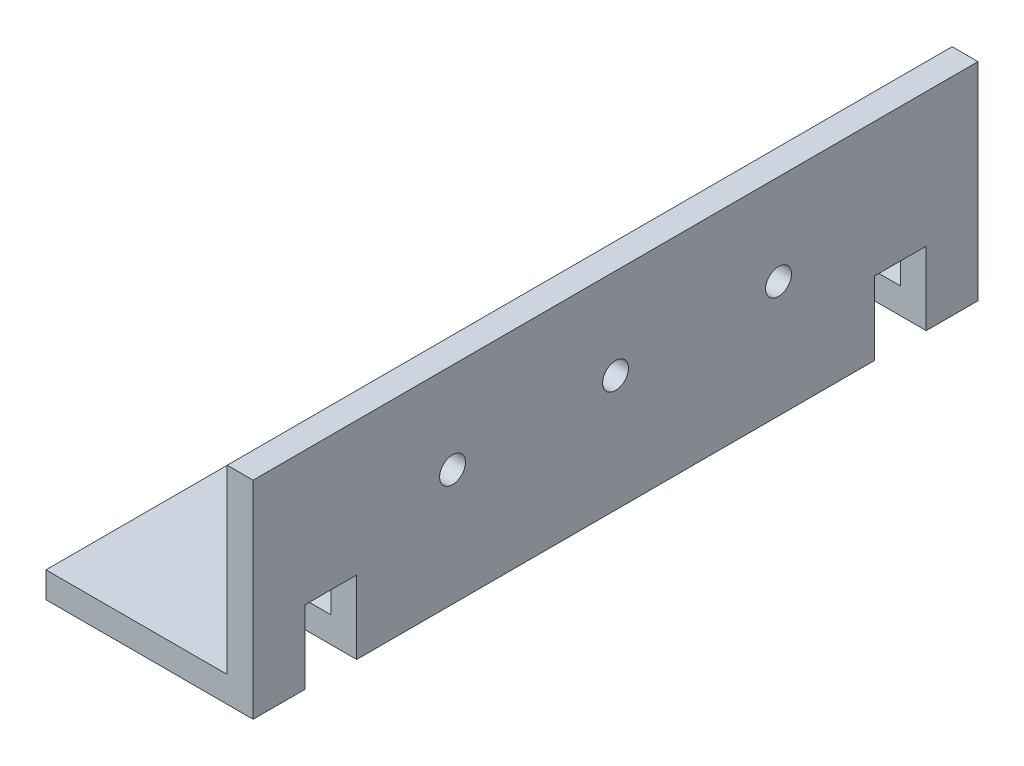
ISO-10303-21;
HEADER;
FILE_DESCRIPTION(('STEP AP214'),'2;1');
FILE_NAME('part.step','',(''),(''),'','','');
FILE_SCHEMA(('AUTOMOTIVE_DESIGN { 1 0 10303 214 1 1 1 1 }'));
ENDSEC;
DATA;
#1=APPLICATION_CONTEXT('core data for automotive mechanical design processes');
#2=APPLICATION_PROTOCOL_DEFINITION('international standard','automotive_design',2000,#1);
#3=PRODUCT_CONTEXT('',#1,'mechanical');
#4=PRODUCT('Part','Part','',(#3));
#5=PRODUCT_RELATED_PRODUCT_CATEGORY('part','',(#4));
#6=PRODUCT_DEFINITION_FORMATION('','',#4);
#7=PRODUCT_DEFINITION_CONTEXT('part definition',#1,'design');
#8=PRODUCT_DEFINITION('design','',#6,#7);
#9=PRODUCT_DEFINITION_SHAPE('','',#8);
#10=(LENGTH_UNIT() NAMED_UNIT(*) SI_UNIT(.MILLI.,.METRE.));
#11=(NAMED_UNIT(*) PLANE_ANGLE_UNIT() SI_UNIT($,.RADIAN.));
#12=(NAMED_UNIT(*) SI_UNIT($,.STERADIAN.) SOLID_ANGLE_UNIT());
#13=UNCERTAINTY_MEASURE_WITH_UNIT(LENGTH_MEASURE(1.E-05),#10,'distance_accuracy_value','');
#14=(GEOMETRIC_REPRESENTATION_CONTEXT(3) GLOBAL_UNCERTAINTY_ASSIGNED_CONTEXT((#13)) GLOBAL_UNIT_ASSIGNED_CONTEXT((#10,
#11,#12)) REPRESENTATION_CONTEXT('',''));
#15=CARTESIAN_POINT('',(0.,0.,0.));
#16=DIRECTION('',(0.,0.,1.));
#17=DIRECTION('',(1.,0.,0.));
#18=AXIS2_PLACEMENT_3D('',#15,#16,#17);
#19=CARTESIAN_POINT('',(-25.4,0.,88.9));
#20=DIRECTION('',(0.,1.,0.));
#21=DIRECTION('',(0.,0.,1.));
#22=AXIS2_PLACEMENT_3D('',#19,#20,#21);
#23=PLANE('',#22);
#24=DIRECTION('',(0.,0.,1.));
#25=VECTOR('',#24,1.);
#26=CARTESIAN_POINT('',(-8.98025612106914,0.,88.9));
#27=LINE('',#26,#25);
#28=CARTESIAN_POINT('',(-8.98025612106914,0.,76.2));
#29=VERTEX_POINT('',#28);
#30=CARTESIAN_POINT('',(-8.98025612106914,0.,82.55));
#31=VERTEX_POINT('',#30);
#32=EDGE_CURVE('E238',#29,#31,#27,.T.);
#33=ORIENTED_EDGE('',*,*,#32,.T.);
#34=DIRECTION('',(1.,0.,0.));
#35=VECTOR('',#34,1.);
#36=CARTESIAN_POINT('',(-25.4,0.,82.55));
#37=LINE('',#36,#35);
#38=CARTESIAN_POINT('',(0.,0.,82.55));
#39=VERTEX_POINT('',#38);
#40=EDGE_CURVE('E249',#31,#39,#37,.T.);
#41=ORIENTED_EDGE('',*,*,#40,.T.);
#42=DIRECTION('',(0.,0.,-1.));
#43=VECTOR('',#42,1.);
#44=CARTESIAN_POINT('',(0.,0.,88.9));
#45=LINE('',#44,#43);
#46=CARTESIAN_POINT('',(0.,0.,88.9));
#47=VERTEX_POINT('',#46);
#48=EDGE_CURVE('E315',#47,#39,#45,.T.);
#49=ORIENTED_EDGE('',*,*,#48,.F.);
#50=DIRECTION('',(1.,0.,0.));
#51=VECTOR('',#50,1.);
#52=CARTESIAN_POINT('',(-25.4,0.,88.9));
#53=LINE('',#52,#51);
#54=CARTESIAN_POINT('',(-25.4,0.,88.9));
#55=VERTEX_POINT('',#54);
#56=EDGE_CURVE('E254',#55,#47,#53,.T.);
#57=ORIENTED_EDGE('',*,*,#56,.F.);
#58=DIRECTION('',(0.,0.,-1.));
#59=VECTOR('',#58,1.);
#60=CARTESIAN_POINT('',(-25.4,0.,88.9));
#61=LINE('',#60,#59);
#62=CARTESIAN_POINT('',(-25.4,0.,0.));
#63=VERTEX_POINT('',#62);
#64=EDGE_CURVE('E274',#55,#63,#61,.T.);
#65=ORIENTED_EDGE('',*,*,#64,.T.);
#66=DIRECTION('',(1.,0.,0.));
#67=VECTOR('',#66,1.);
#68=CARTESIAN_POINT('',(-25.4,0.,0.));
#69=LINE('',#68,#67);
#70=CARTESIAN_POINT('',(0.,0.,0.));
#71=VERTEX_POINT('',#70);
#72=EDGE_CURVE('E253',#63,#71,#69,.T.);
#73=ORIENTED_EDGE('',*,*,#72,.T.);
#74=CARTESIAN_POINT('',(0.,0.,6.34999999999999));
#75=VERTEX_POINT('',#74);
#76=EDGE_CURVE('E314',#75,#71,#45,.T.);
#77=ORIENTED_EDGE('',*,*,#76,.F.);
#78=DIRECTION('',(-1.,0.,0.));
#79=VECTOR('',#78,1.);
#80=CARTESIAN_POINT('',(-25.4,0.,6.34999999999999));
#81=LINE('',#80,#79);
#82=CARTESIAN_POINT('',(-8.98025612106916,0.,6.34999999999999));
#83=VERTEX_POINT('',#82);
#84=EDGE_CURVE('E196',#75,#83,#81,.T.);
#85=ORIENTED_EDGE('',*,*,#84,.T.);
#86=DIRECTION('',(0.,0.,1.));
#87=VECTOR('',#86,1.);
#88=CARTESIAN_POINT('',(-8.98025612106914,0.,88.9));
#89=LINE('',#88,#87);
#90=CARTESIAN_POINT('',(-8.98025612106916,0.,12.7));
#91=VERTEX_POINT('',#90);
#92=EDGE_CURVE('E185',#83,#91,#89,.T.);
#93=ORIENTED_EDGE('',*,*,#92,.T.);
#94=DIRECTION('',(1.,0.,0.));
#95=VECTOR('',#94,1.);
#96=CARTESIAN_POINT('',(-25.4,0.,12.7));
#97=LINE('',#96,#95);
#98=CARTESIAN_POINT('',(0.,0.,12.7));
#99=VERTEX_POINT('',#98);
#100=EDGE_CURVE('E168',#91,#99,#97,.T.);
#101=ORIENTED_EDGE('',*,*,#100,.T.);
#102=CARTESIAN_POINT('',(0.,0.,76.2));
#103=VERTEX_POINT('',#102);
#104=EDGE_CURVE('E319',#103,#99,#45,.T.);
#105=ORIENTED_EDGE('',*,*,#104,.F.);
#106=DIRECTION('',(-1.,0.,0.));
#107=VECTOR('',#106,1.);
#108=CARTESIAN_POINT('',(-25.4,0.,76.2));
#109=LINE('',#108,#107);
#110=EDGE_CURVE('E65',#103,#29,#109,.T.);
#111=ORIENTED_EDGE('',*,*,#110,.T.);
#112=EDGE_LOOP('',(#33,#41,#49,#57,#65,#73,#77,#85,#93,#101,#105,#111));
#113=FACE_BOUND('',#112,.T.);
#114=ADVANCED_FACE('F42',(#113),#23,.F.);
#115=CARTESIAN_POINT('',(0.,0.,88.9));
#116=DIRECTION('',(-1.,0.,0.));
#117=DIRECTION('',(0.,0.,1.));
#118=AXIS2_PLACEMENT_3D('',#115,#116,#117);
#119=PLANE('',#118);
#120=CARTESIAN_POINT('',(0.,14.2875,64.4398));
#121=DIRECTION('',(-1.,0.,0.));
#122=DIRECTION('',(0.,-1.,0.));
#123=AXIS2_PLACEMENT_3D('',#120,#121,#122);
#124=CIRCLE('',#123,1.5875);
#125=CARTESIAN_POINT('',(0.,12.7,64.4398));
#126=VERTEX_POINT('',#125);
#127=EDGE_CURVE('E378',#126,#126,#124,.T.);
#128=ORIENTED_EDGE('',*,*,#127,.T.);
#129=EDGE_LOOP('',(#128));
#130=FACE_BOUND('',#129,.T.);
#131=CARTESIAN_POINT('',(0.,14.2875,24.4602));
#132=DIRECTION('',(-1.,0.,0.));
#133=DIRECTION('',(0.,-1.,0.));
#134=AXIS2_PLACEMENT_3D('',#131,#132,#133);
#135=CIRCLE('',#134,1.5875);
#136=CARTESIAN_POINT('',(0.,12.7,24.4602));
#137=VERTEX_POINT('',#136);
#138=EDGE_CURVE('E372',#137,#137,#135,.T.);
#139=ORIENTED_EDGE('',*,*,#138,.T.);
#140=EDGE_LOOP('',(#139));
#141=FACE_BOUND('',#140,.T.);
#142=CARTESIAN_POINT('',(0.,14.2875,44.45));
#143=DIRECTION('',(-1.,0.,0.));
#144=DIRECTION('',(0.,-1.,0.));
#145=AXIS2_PLACEMENT_3D('',#142,#143,#144);
#146=CIRCLE('',#145,1.5875);
#147=CARTESIAN_POINT('',(0.,12.7,44.45));
#148=VERTEX_POINT('',#147);
#149=EDGE_CURVE('E364',#148,#148,#146,.T.);
#150=ORIENTED_EDGE('',*,*,#149,.T.);
#151=EDGE_LOOP('',(#150));
#152=FACE_BOUND('',#151,.T.);
#153=ORIENTED_EDGE('',*,*,#48,.T.);
#154=DIRECTION('',(0.,1.,0.));
#155=VECTOR('',#154,1.);
#156=CARTESIAN_POINT('',(0.,0.,82.55));
#157=LINE('',#156,#155);
#158=CARTESIAN_POINT('',(0.,8.98025612106912,82.55));
#159=VERTEX_POINT('',#158);
#160=EDGE_CURVE('E245',#39,#159,#157,.T.);
#161=ORIENTED_EDGE('',*,*,#160,.T.);
#162=DIRECTION('',(0.,0.,-1.));
#163=VECTOR('',#162,1.);
#164=CARTESIAN_POINT('',(0.,8.98025612106912,88.9));
#165=LINE('',#164,#163);
#166=CARTESIAN_POINT('',(0.,8.98025612106913,76.2));
#167=VERTEX_POINT('',#166);
#168=EDGE_CURVE('E234',#159,#167,#165,.T.);
#169=ORIENTED_EDGE('',*,*,#168,.T.);
#170=DIRECTION('',(0.,-1.,0.));
#171=VECTOR('',#170,1.);
#172=CARTESIAN_POINT('',(0.,0.,76.2));
#173=LINE('',#172,#171);
#174=EDGE_CURVE('E225',#167,#103,#173,.T.);
#175=ORIENTED_EDGE('',*,*,#174,.T.);
#176=ORIENTED_EDGE('',*,*,#104,.T.);
#177=DIRECTION('',(0.,1.,0.));
#178=VECTOR('',#177,1.);
#179=CARTESIAN_POINT('',(0.,0.,12.7));
#180=LINE('',#179,#178);
#181=CARTESIAN_POINT('',(0.,8.98025612106913,12.7));
#182=VERTEX_POINT('',#181);
#183=EDGE_CURVE('E175',#99,#182,#180,.T.);
#184=ORIENTED_EDGE('',*,*,#183,.T.);
#185=DIRECTION('',(0.,0.,-1.));
#186=VECTOR('',#185,1.);
#187=CARTESIAN_POINT('',(0.,8.98025612106912,88.9));
#188=LINE('',#187,#186);
#189=CARTESIAN_POINT('',(0.,8.98025612106914,6.34999999999999));
#190=VERTEX_POINT('',#189);
#191=EDGE_CURVE('E199',#182,#190,#188,.T.);
#192=ORIENTED_EDGE('',*,*,#191,.T.);
#193=DIRECTION('',(0.,-1.,0.));
#194=VECTOR('',#193,1.);
#195=CARTESIAN_POINT('',(0.,0.,6.34999999999999));
#196=LINE('',#195,#194);
#197=EDGE_CURVE('E215',#190,#75,#196,.T.);
#198=ORIENTED_EDGE('',*,*,#197,.T.);
#199=ORIENTED_EDGE('',*,*,#76,.T.);
#200=DIRECTION('',(0.,1.,0.));
#201=VECTOR('',#200,1.);
#202=CARTESIAN_POINT('',(0.,0.,0.));
#203=LINE('',#202,#201);
#204=CARTESIAN_POINT('',(0.,25.4,0.));
#205=VERTEX_POINT('',#204);
#206=EDGE_CURVE('E278',#71,#205,#203,.T.);
#207=ORIENTED_EDGE('',*,*,#206,.T.);
#208=DIRECTION('',(0.,0.,-1.));
#209=VECTOR('',#208,1.);
#210=CARTESIAN_POINT('',(0.,25.4,88.9));
#211=LINE('',#210,#209);
#212=CARTESIAN_POINT('',(0.,25.4,88.9));
#213=VERTEX_POINT('',#212);
#214=EDGE_CURVE('E310',#213,#205,#211,.T.);
#215=ORIENTED_EDGE('',*,*,#214,.F.);
#216=DIRECTION('',(0.,1.,0.));
#217=VECTOR('',#216,1.);
#218=CARTESIAN_POINT('',(0.,0.,88.9));
#219=LINE('',#218,#217);
#220=EDGE_CURVE('E258',#47,#213,#219,.T.);
#221=ORIENTED_EDGE('',*,*,#220,.F.);
#222=EDGE_LOOP('',(#153,#161,#169,#175,#176,#184,#192,#198,#199,#207,#215,#221));
#223=FACE_BOUND('',#222,.T.);
#224=ADVANCED_FACE('F390',(#130,#141,#152,#223),#119,.F.);
#225=CARTESIAN_POINT('',(0.,25.4,88.9));
#226=DIRECTION('',(0.,-1.,0.));
#227=DIRECTION('',(0.,0.,-1.));
#228=AXIS2_PLACEMENT_3D('',#225,#226,#227);
#229=PLANE('',#228);
#230=DIRECTION('',(-1.,0.,0.));
#231=VECTOR('',#230,1.);
#232=CARTESIAN_POINT('',(0.,25.4,0.));
#233=LINE('',#232,#231);
#234=CARTESIAN_POINT('',(-3.175,25.4,0.));
#235=VERTEX_POINT('',#234);
#236=EDGE_CURVE('E281',#205,#235,#233,.T.);
#237=ORIENTED_EDGE('',*,*,#236,.T.);
#238=DIRECTION('',(0.,0.,-1.));
#239=VECTOR('',#238,1.);
#240=CARTESIAN_POINT('',(-3.175,25.4,88.9));
#241=LINE('',#240,#239);
#242=CARTESIAN_POINT('',(-3.175,25.4,88.9));
#243=VERTEX_POINT('',#242);
#244=EDGE_CURVE('E305',#243,#235,#241,.T.);
#245=ORIENTED_EDGE('',*,*,#244,.F.);
#246=DIRECTION('',(-1.,0.,0.));
#247=VECTOR('',#246,1.);
#248=CARTESIAN_POINT('',(0.,25.4,88.9));
#249=LINE('',#248,#247);
#250=EDGE_CURVE('E262',#213,#243,#249,.T.);
#251=ORIENTED_EDGE('',*,*,#250,.F.);
#252=ORIENTED_EDGE('',*,*,#214,.T.);
#253=EDGE_LOOP('',(#237,#245,#251,#252));
#254=FACE_BOUND('',#253,.T.);
#255=ADVANCED_FACE('F403',(#254),#229,.F.);
#256=CARTESIAN_POINT('',(-3.175,25.4,88.9));
#257=DIRECTION('',(1.,0.,0.));
#258=DIRECTION('',(0.,1.,0.));
#259=AXIS2_PLACEMENT_3D('',#256,#257,#258);
#260=PLANE('',#259);
#261=CARTESIAN_POINT('',(-3.175,14.2875,64.4398));
#262=DIRECTION('',(-1.,0.,0.));
#263=DIRECTION('',(0.,-1.,0.));
#264=AXIS2_PLACEMENT_3D('',#261,#262,#263);
#265=CIRCLE('',#264,1.5875);
#266=CARTESIAN_POINT('',(-3.175,12.7,64.4398));
#267=VERTEX_POINT('',#266);
#268=EDGE_CURVE('E374',#267,#267,#265,.T.);
#269=ORIENTED_EDGE('',*,*,#268,.F.);
#270=EDGE_LOOP('',(#269));
#271=FACE_BOUND('',#270,.T.);
#272=CARTESIAN_POINT('',(-3.175,14.2875,24.4602));
#273=DIRECTION('',(-1.,0.,0.));
#274=DIRECTION('',(0.,-1.,0.));
#275=AXIS2_PLACEMENT_3D('',#272,#273,#274);
#276=CIRCLE('',#275,1.5875);
#277=CARTESIAN_POINT('',(-3.175,12.7,24.4602));
#278=VERTEX_POINT('',#277);
#279=EDGE_CURVE('E382',#278,#278,#276,.T.);
#280=ORIENTED_EDGE('',*,*,#279,.F.);
#281=EDGE_LOOP('',(#280));
#282=FACE_BOUND('',#281,.T.);
#283=CARTESIAN_POINT('',(-3.175,14.2875,44.45));
#284=DIRECTION('',(-1.,0.,0.));
#285=DIRECTION('',(0.,-1.,0.));
#286=AXIS2_PLACEMENT_3D('',#283,#284,#285);
#287=CIRCLE('',#286,1.5875);
#288=CARTESIAN_POINT('',(-3.175,12.7,44.45));
#289=VERTEX_POINT('',#288);
#290=EDGE_CURVE('E356',#289,#289,#287,.T.);
#291=ORIENTED_EDGE('',*,*,#290,.F.);
#292=EDGE_LOOP('',(#291));
#293=FACE_BOUND('',#292,.T.);
#294=DIRECTION('',(0.,0.,1.));
#295=VECTOR('',#294,1.);
#296=CARTESIAN_POINT('',(-3.175,5.80525612106913,88.9));
#297=LINE('',#296,#295);
#298=CARTESIAN_POINT('',(-3.175,5.80525612106913,76.2));
#299=VERTEX_POINT('',#298);
#300=CARTESIAN_POINT('',(-3.175,5.80525612106913,82.55));
#301=VERTEX_POINT('',#300);
#302=EDGE_CURVE('E230',#299,#301,#297,.T.);
#303=ORIENTED_EDGE('',*,*,#302,.T.);
#304=DIRECTION('',(0.,-1.,0.));
#305=VECTOR('',#304,1.);
#306=CARTESIAN_POINT('',(-3.175,25.4,82.55));
#307=LINE('',#306,#305);
#308=CARTESIAN_POINT('',(-3.175,3.175,82.55));
#309=VERTEX_POINT('',#308);
#310=EDGE_CURVE('E241',#301,#309,#307,.T.);
#311=ORIENTED_EDGE('',*,*,#310,.T.);
#312=DIRECTION('',(0.,0.,-1.));
#313=VECTOR('',#312,1.);
#314=CARTESIAN_POINT('',(-3.175,3.175,88.9));
#315=LINE('',#314,#313);
#316=CARTESIAN_POINT('',(-3.175,3.175,88.9));
#317=VERTEX_POINT('',#316);
#318=EDGE_CURVE('E301',#317,#309,#315,.T.);
#319=ORIENTED_EDGE('',*,*,#318,.F.);
#320=DIRECTION('',(0.,-1.,0.));
#321=VECTOR('',#320,1.);
#322=CARTESIAN_POINT('',(-3.175,25.4,88.9));
#323=LINE('',#322,#321);
#324=EDGE_CURVE('E265',#243,#317,#323,.T.);
#325=ORIENTED_EDGE('',*,*,#324,.F.);
#326=ORIENTED_EDGE('',*,*,#244,.T.);
#327=DIRECTION('',(0.,-1.,0.));
#328=VECTOR('',#327,1.);
#329=CARTESIAN_POINT('',(-3.175,25.4,0.));
#330=LINE('',#329,#328);
#331=CARTESIAN_POINT('',(-3.175,3.175,0.));
#332=VERTEX_POINT('',#331);
#333=EDGE_CURVE('E284',#235,#332,#330,.T.);
#334=ORIENTED_EDGE('',*,*,#333,.T.);
#335=CARTESIAN_POINT('',(-3.175,3.175,6.34999999999999));
#336=VERTEX_POINT('',#335);
#337=EDGE_CURVE('E300',#336,#332,#315,.T.);
#338=ORIENTED_EDGE('',*,*,#337,.F.);
#339=DIRECTION('',(0.,1.,0.));
#340=VECTOR('',#339,1.);
#341=CARTESIAN_POINT('',(-3.175,25.4,6.34999999999999));
#342=LINE('',#341,#340);
#343=CARTESIAN_POINT('',(-3.17500000000001,5.80525612106914,6.34999999999999));
#344=VERTEX_POINT('',#343);
#345=EDGE_CURVE('E181',#336,#344,#342,.T.);
#346=ORIENTED_EDGE('',*,*,#345,.T.);
#347=DIRECTION('',(0.,0.,1.));
#348=VECTOR('',#347,1.);
#349=CARTESIAN_POINT('',(-3.175,5.80525612106912,88.9));
#350=LINE('',#349,#348);
#351=CARTESIAN_POINT('',(-3.175,5.80525612106914,12.7));
#352=VERTEX_POINT('',#351);
#353=EDGE_CURVE('E206',#344,#352,#350,.T.);
#354=ORIENTED_EDGE('',*,*,#353,.T.);
#355=DIRECTION('',(0.,-1.,0.));
#356=VECTOR('',#355,1.);
#357=CARTESIAN_POINT('',(-3.175,25.4,12.7));
#358=LINE('',#357,#356);
#359=CARTESIAN_POINT('',(-3.175,3.175,12.7));
#360=VERTEX_POINT('',#359);
#361=EDGE_CURVE('E198',#352,#360,#358,.T.);
#362=ORIENTED_EDGE('',*,*,#361,.T.);
#363=CARTESIAN_POINT('',(-3.175,3.175,76.2));
#364=VERTEX_POINT('',#363);
#365=EDGE_CURVE('E306',#364,#360,#315,.T.);
#366=ORIENTED_EDGE('',*,*,#365,.F.);
#367=DIRECTION('',(0.,1.,0.));
#368=VECTOR('',#367,1.);
#369=CARTESIAN_POINT('',(-3.175,25.4,76.2));
#370=LINE('',#369,#368);
#371=EDGE_CURVE('E221',#364,#299,#370,.T.);
#372=ORIENTED_EDGE('',*,*,#371,.T.);
#373=EDGE_LOOP('',(#303,#311,#319,#325,#326,#334,#338,#346,#354,#362,#366,#372));
#374=FACE_BOUND('',#373,.T.);
#375=ADVANCED_FACE('F400',(#271,#282,#293,#374),#260,.F.);
#376=CARTESIAN_POINT('',(-3.175,3.175,88.9));
#377=DIRECTION('',(0.,-1.,0.));
#378=DIRECTION('',(1.,0.,0.));
#379=AXIS2_PLACEMENT_3D('',#376,#377,#378);
#380=PLANE('',#379);
#381=ORIENTED_EDGE('',*,*,#318,.T.);
#382=DIRECTION('',(-1.,0.,0.));
#383=VECTOR('',#382,1.);
#384=CARTESIAN_POINT('',(-3.175,3.175,82.55));
#385=LINE('',#384,#383);
#386=CARTESIAN_POINT('',(-5.80525612106914,3.175,82.55));
#387=VERTEX_POINT('',#386);
#388=EDGE_CURVE('E11',#309,#387,#385,.T.);
#389=ORIENTED_EDGE('',*,*,#388,.T.);
#390=DIRECTION('',(0.,0.,-1.));
#391=VECTOR('',#390,1.);
#392=CARTESIAN_POINT('',(-5.80525612106914,3.175,88.9));
#393=LINE('',#392,#391);
#394=CARTESIAN_POINT('',(-5.80525612106914,3.175,76.2));
#395=VERTEX_POINT('',#394);
#396=EDGE_CURVE('E50',#387,#395,#393,.T.);
#397=ORIENTED_EDGE('',*,*,#396,.T.);
#398=DIRECTION('',(1.,0.,0.));
#399=VECTOR('',#398,1.);
#400=CARTESIAN_POINT('',(-3.175,3.175,76.2));
#401=LINE('',#400,#399);
#402=EDGE_CURVE('E329',#395,#364,#401,.T.);
#403=ORIENTED_EDGE('',*,*,#402,.T.);
#404=ORIENTED_EDGE('',*,*,#365,.T.);
#405=DIRECTION('',(-1.,0.,0.));
#406=VECTOR('',#405,1.);
#407=CARTESIAN_POINT('',(-3.175,3.175,12.7));
#408=LINE('',#407,#406);
#409=CARTESIAN_POINT('',(-5.80525612106915,3.175,12.7));
#410=VERTEX_POINT('',#409);
#411=EDGE_CURVE('E322',#360,#410,#408,.T.);
#412=ORIENTED_EDGE('',*,*,#411,.T.);
#413=DIRECTION('',(0.,0.,-1.));
#414=VECTOR('',#413,1.);
#415=CARTESIAN_POINT('',(-5.80525612106913,3.175,88.9));
#416=LINE('',#415,#414);
#417=CARTESIAN_POINT('',(-5.80525612106915,3.175,6.34999999999999));
#418=VERTEX_POINT('',#417);
#419=EDGE_CURVE('E188',#410,#418,#416,.T.);
#420=ORIENTED_EDGE('',*,*,#419,.T.);
#421=DIRECTION('',(1.,0.,0.));
#422=VECTOR('',#421,1.);
#423=CARTESIAN_POINT('',(-3.175,3.175,6.34999999999999));
#424=LINE('',#423,#422);
#425=EDGE_CURVE('E325',#418,#336,#424,.T.);
#426=ORIENTED_EDGE('',*,*,#425,.T.);
#427=ORIENTED_EDGE('',*,*,#337,.T.);
#428=DIRECTION('',(-1.,0.,0.));
#429=VECTOR('',#428,1.);
#430=CARTESIAN_POINT('',(-3.175,3.175,0.));
#431=LINE('',#430,#429);
#432=CARTESIAN_POINT('',(-25.4,3.175,0.));
#433=VERTEX_POINT('',#432);
#434=EDGE_CURVE('E288',#332,#433,#431,.T.);
#435=ORIENTED_EDGE('',*,*,#434,.T.);
#436=DIRECTION('',(0.,0.,-1.));
#437=VECTOR('',#436,1.);
#438=CARTESIAN_POINT('',(-25.4,3.175,88.9));
#439=LINE('',#438,#437);
#440=CARTESIAN_POINT('',(-25.4,3.175,88.9));
#441=VERTEX_POINT('',#440);
#442=EDGE_CURVE('E296',#441,#433,#439,.T.);
#443=ORIENTED_EDGE('',*,*,#442,.F.);
#444=DIRECTION('',(-1.,0.,0.));
#445=VECTOR('',#444,1.);
#446=CARTESIAN_POINT('',(-3.175,3.175,88.9));
#447=LINE('',#446,#445);
#448=EDGE_CURVE('E268',#317,#441,#447,.T.);
#449=ORIENTED_EDGE('',*,*,#448,.F.);
#450=EDGE_LOOP('',(#381,#389,#397,#403,#404,#412,#420,#426,#427,#435,#443,#449));
#451=FACE_BOUND('',#450,.T.);
#452=ADVANCED_FACE('F335',(#451),#380,.F.);
#453=CARTESIAN_POINT('',(-25.4,3.175,88.9));
#454=DIRECTION('',(1.,0.,0.));
#455=DIRECTION('',(0.,1.,0.));
#456=AXIS2_PLACEMENT_3D('',#453,#454,#455);
#457=PLANE('',#456);
#458=DIRECTION('',(0.,-1.,0.));
#459=VECTOR('',#458,1.);
#460=CARTESIAN_POINT('',(-25.4,3.175,0.));
#461=LINE('',#460,#459);
#462=EDGE_CURVE('E259',#433,#63,#461,.T.);
#463=ORIENTED_EDGE('',*,*,#462,.T.);
#464=ORIENTED_EDGE('',*,*,#64,.F.);
#465=DIRECTION('',(0.,-1.,0.));
#466=VECTOR('',#465,1.);
#467=CARTESIAN_POINT('',(-25.4,3.175,88.9));
#468=LINE('',#467,#466);
#469=EDGE_CURVE('E271',#441,#55,#468,.T.);
#470=ORIENTED_EDGE('',*,*,#469,.F.);
#471=ORIENTED_EDGE('',*,*,#442,.T.);
#472=EDGE_LOOP('',(#463,#464,#470,#471));
#473=FACE_BOUND('',#472,.T.);
#474=ADVANCED_FACE('F430',(#473),#457,.F.);
#475=CARTESIAN_POINT('',(0.,0.,88.9));
#476=DIRECTION('',(0.,0.,1.));
#477=DIRECTION('',(1.,0.,0.));
#478=AXIS2_PLACEMENT_3D('',#475,#476,#477);
#479=PLANE('',#478);
#480=ORIENTED_EDGE('',*,*,#56,.T.);
#481=ORIENTED_EDGE('',*,*,#220,.T.);
#482=ORIENTED_EDGE('',*,*,#250,.T.);
#483=ORIENTED_EDGE('',*,*,#324,.T.);
#484=ORIENTED_EDGE('',*,*,#448,.T.);
#485=ORIENTED_EDGE('',*,*,#469,.T.);
#486=EDGE_LOOP('',(#480,#481,#482,#483,#484,#485));
#487=FACE_BOUND('',#486,.T.);
#488=ADVANCED_FACE('F442',(#487),#479,.T.);
#489=CARTESIAN_POINT('',(0.,0.,0.));
#490=DIRECTION('',(0.,0.,1.));
#491=DIRECTION('',(1.,0.,0.));
#492=AXIS2_PLACEMENT_3D('',#489,#490,#491);
#493=PLANE('',#492);
#494=ORIENTED_EDGE('',*,*,#72,.F.);
#495=ORIENTED_EDGE('',*,*,#462,.F.);
#496=ORIENTED_EDGE('',*,*,#434,.F.);
#497=ORIENTED_EDGE('',*,*,#333,.F.);
#498=ORIENTED_EDGE('',*,*,#236,.F.);
#499=ORIENTED_EDGE('',*,*,#206,.F.);
#500=EDGE_LOOP('',(#494,#495,#496,#497,#498,#499));
#501=FACE_BOUND('',#500,.T.);
#502=ADVANCED_FACE('F422',(#501),#493,.F.);
#503=CARTESIAN_POINT('',(-12.7,-12.7,6.34999999999999));
#504=DIRECTION('',(0.,0.,-1.));
#505=DIRECTION('',(-1.,0.,0.));
#506=AXIS2_PLACEMENT_3D('',#503,#504,#505);
#507=PLANE('',#506);
#508=ORIENTED_EDGE('',*,*,#197,.F.);
#509=DIRECTION('',(0.707106781186548,0.707106781186547,0.));
#510=VECTOR('',#509,1.);
#511=CARTESIAN_POINT('',(-17.1901280605346,-8.20987193946542,6.34999999999999));
#512=LINE('',#511,#510);
#513=EDGE_CURVE('E57',#344,#190,#512,.T.);
#514=ORIENTED_EDGE('',*,*,#513,.F.);
#515=ORIENTED_EDGE('',*,*,#345,.F.);
#516=ORIENTED_EDGE('',*,*,#425,.F.);
#517=EDGE_CURVE('E362',#83,#418,#512,.T.);
#518=ORIENTED_EDGE('',*,*,#517,.F.);
#519=ORIENTED_EDGE('',*,*,#84,.F.);
#520=EDGE_LOOP('',(#508,#514,#515,#516,#518,#519));
#521=FACE_BOUND('',#520,.T.);
#522=ADVANCED_FACE('F450',(#521),#507,.F.);
#523=CARTESIAN_POINT('',(-12.7,-12.7,12.7));
#524=DIRECTION('',(0.,0.,1.));
#525=DIRECTION('',(1.,0.,0.));
#526=AXIS2_PLACEMENT_3D('',#523,#524,#525);
#527=PLANE('',#526);
#528=DIRECTION('',(0.707106781186548,0.707106781186547,0.));
#529=VECTOR('',#528,1.);
#530=CARTESIAN_POINT('',(-17.1901280605346,-8.20987193946542,12.7));
#531=LINE('',#530,#529);
#532=EDGE_CURVE('E171',#91,#410,#531,.T.);
#533=ORIENTED_EDGE('',*,*,#532,.T.);
#534=ORIENTED_EDGE('',*,*,#411,.F.);
#535=ORIENTED_EDGE('',*,*,#361,.F.);
#536=EDGE_CURVE('E191',#352,#182,#531,.T.);
#537=ORIENTED_EDGE('',*,*,#536,.T.);
#538=ORIENTED_EDGE('',*,*,#183,.F.);
#539=ORIENTED_EDGE('',*,*,#100,.F.);
#540=EDGE_LOOP('',(#533,#534,#535,#537,#538,#539));
#541=FACE_BOUND('',#540,.T.);
#542=ADVANCED_FACE('F170',(#541),#527,.F.);
#543=CARTESIAN_POINT('',(-17.1901280605346,-8.20987193946542,6.34999999999999));
#544=DIRECTION('',(-0.707106781186547,0.707106781186548,0.));
#545=DIRECTION('',(-0.707106781186548,-0.707106781186547,0.));
#546=AXIS2_PLACEMENT_3D('',#543,#544,#545);
#547=PLANE('',#546);
#548=ORIENTED_EDGE('',*,*,#517,.T.);
#549=ORIENTED_EDGE('',*,*,#419,.F.);
#550=ORIENTED_EDGE('',*,*,#532,.F.);
#551=ORIENTED_EDGE('',*,*,#92,.F.);
#552=EDGE_LOOP('',(#548,#549,#550,#551));
#553=FACE_BOUND('',#552,.T.);
#554=ADVANCED_FACE('F184',(#553),#547,.F.);
#555=ORIENTED_EDGE('',*,*,#536,.F.);
#556=ORIENTED_EDGE('',*,*,#353,.F.);
#557=ORIENTED_EDGE('',*,*,#513,.T.);
#558=ORIENTED_EDGE('',*,*,#191,.F.);
#559=EDGE_LOOP('',(#555,#556,#557,#558));
#560=FACE_BOUND('',#559,.T.);
#561=ADVANCED_FACE('F545',(#560),#547,.F.);
#562=CARTESIAN_POINT('',(-12.7,-12.7,82.55));
#563=DIRECTION('',(0.,0.,1.));
#564=DIRECTION('',(1.,0.,0.));
#565=AXIS2_PLACEMENT_3D('',#562,#563,#564);
#566=PLANE('',#565);
#567=DIRECTION('',(0.707106781186548,0.707106781186547,0.));
#568=VECTOR('',#567,1.);
#569=CARTESIAN_POINT('',(-17.1901280605346,-8.20987193946543,82.55));
#570=LINE('',#569,#568);
#571=EDGE_CURVE('E343',#31,#387,#570,.T.);
#572=ORIENTED_EDGE('',*,*,#571,.T.);
#573=ORIENTED_EDGE('',*,*,#388,.F.);
#574=ORIENTED_EDGE('',*,*,#310,.F.);
#575=EDGE_CURVE('E348',#301,#159,#570,.T.);
#576=ORIENTED_EDGE('',*,*,#575,.T.);
#577=ORIENTED_EDGE('',*,*,#160,.F.);
#578=ORIENTED_EDGE('',*,*,#40,.F.);
#579=EDGE_LOOP('',(#572,#573,#574,#576,#577,#578));
#580=FACE_BOUND('',#579,.T.);
#581=ADVANCED_FACE('F346',(#580),#566,.F.);
#582=CARTESIAN_POINT('',(-17.1901280605346,-8.20987193946543,82.55));
#583=DIRECTION('',(-0.707106781186547,0.707106781186548,0.));
#584=DIRECTION('',(-0.707106781186548,-0.707106781186547,0.));
#585=AXIS2_PLACEMENT_3D('',#582,#583,#584);
#586=PLANE('',#585);
#587=DIRECTION('',(0.707106781186548,0.707106781186547,0.));
#588=VECTOR('',#587,1.);
#589=CARTESIAN_POINT('',(-17.1901280605346,-8.20987193946543,76.2));
#590=LINE('',#589,#588);
#591=EDGE_CURVE('E344',#29,#395,#590,.T.);
#592=ORIENTED_EDGE('',*,*,#591,.T.);
#593=ORIENTED_EDGE('',*,*,#396,.F.);
#594=ORIENTED_EDGE('',*,*,#571,.F.);
#595=ORIENTED_EDGE('',*,*,#32,.F.);
#596=EDGE_LOOP('',(#592,#593,#594,#595));
#597=FACE_BOUND('',#596,.T.);
#598=ADVANCED_FACE('F342',(#597),#586,.F.);
#599=ORIENTED_EDGE('',*,*,#575,.F.);
#600=ORIENTED_EDGE('',*,*,#302,.F.);
#601=EDGE_CURVE('E190',#299,#167,#590,.T.);
#602=ORIENTED_EDGE('',*,*,#601,.T.);
#603=ORIENTED_EDGE('',*,*,#168,.F.);
#604=EDGE_LOOP('',(#599,#600,#602,#603));
#605=FACE_BOUND('',#604,.T.);
#606=ADVANCED_FACE('F412',(#605),#586,.F.);
#607=CARTESIAN_POINT('',(-12.7,-12.7,76.2));
#608=DIRECTION('',(0.,0.,-1.));
#609=DIRECTION('',(-1.,0.,0.));
#610=AXIS2_PLACEMENT_3D('',#607,#608,#609);
#611=PLANE('',#610);
#612=ORIENTED_EDGE('',*,*,#174,.F.);
#613=ORIENTED_EDGE('',*,*,#601,.F.);
#614=ORIENTED_EDGE('',*,*,#371,.F.);
#615=ORIENTED_EDGE('',*,*,#402,.F.);
#616=ORIENTED_EDGE('',*,*,#591,.F.);
#617=ORIENTED_EDGE('',*,*,#110,.F.);
#618=EDGE_LOOP('',(#612,#613,#614,#615,#616,#617));
#619=FACE_BOUND('',#618,.T.);
#620=ADVANCED_FACE('F413',(#619),#611,.F.);
#621=CARTESIAN_POINT('',(0.,14.2875,44.45));
#622=DIRECTION('',(-1.,0.,0.));
#623=DIRECTION('',(0.,-1.,0.));
#624=AXIS2_PLACEMENT_3D('',#621,#622,#623);
#625=CYLINDRICAL_SURFACE('',#624,1.5875);
#626=ORIENTED_EDGE('',*,*,#149,.F.);
#627=EDGE_LOOP('',(#626));
#628=FACE_BOUND('',#627,.T.);
#629=ORIENTED_EDGE('',*,*,#290,.T.);
#630=EDGE_LOOP('',(#629));
#631=FACE_BOUND('',#630,.T.);
#632=ADVANCED_FACE('F396',(#628,#631),#625,.F.);
#633=CARTESIAN_POINT('',(0.,14.2875,24.4602));
#634=DIRECTION('',(-1.,0.,0.));
#635=DIRECTION('',(0.,-1.,0.));
#636=AXIS2_PLACEMENT_3D('',#633,#634,#635);
#637=CYLINDRICAL_SURFACE('',#636,1.5875);
#638=ORIENTED_EDGE('',*,*,#138,.F.);
#639=EDGE_LOOP('',(#638));
#640=FACE_BOUND('',#639,.T.);
#641=ORIENTED_EDGE('',*,*,#279,.T.);
#642=EDGE_LOOP('',(#641));
#643=FACE_BOUND('',#642,.T.);
#644=ADVANCED_FACE('F392',(#640,#643),#637,.F.);
#645=CARTESIAN_POINT('',(0.,14.2875,64.4398));
#646=DIRECTION('',(-1.,0.,0.));
#647=DIRECTION('',(0.,-1.,0.));
#648=AXIS2_PLACEMENT_3D('',#645,#646,#647);
#649=CYLINDRICAL_SURFACE('',#648,1.5875);
#650=ORIENTED_EDGE('',*,*,#127,.F.);
#651=EDGE_LOOP('',(#650));
#652=FACE_BOUND('',#651,.T.);
#653=ORIENTED_EDGE('',*,*,#268,.T.);
#654=EDGE_LOOP('',(#653));
#655=FACE_BOUND('',#654,.T.);
#656=ADVANCED_FACE('F395',(#652,#655),#649,.F.);
#657=CLOSED_SHELL('',(#114,#224,#255,#375,#452,#474,#488,#502,#522,#542,#554,#561,#581,#598,
#606,#620,#632,#644,#656));
#658=MANIFOLD_SOLID_BREP('B2',#657);
#659=ADVANCED_BREP_SHAPE_REPRESENTATION('',(#18,#658),#14);
#660=SHAPE_DEFINITION_REPRESENTATION(#9,#659);
ENDSEC;
END-ISO-10303-21;
